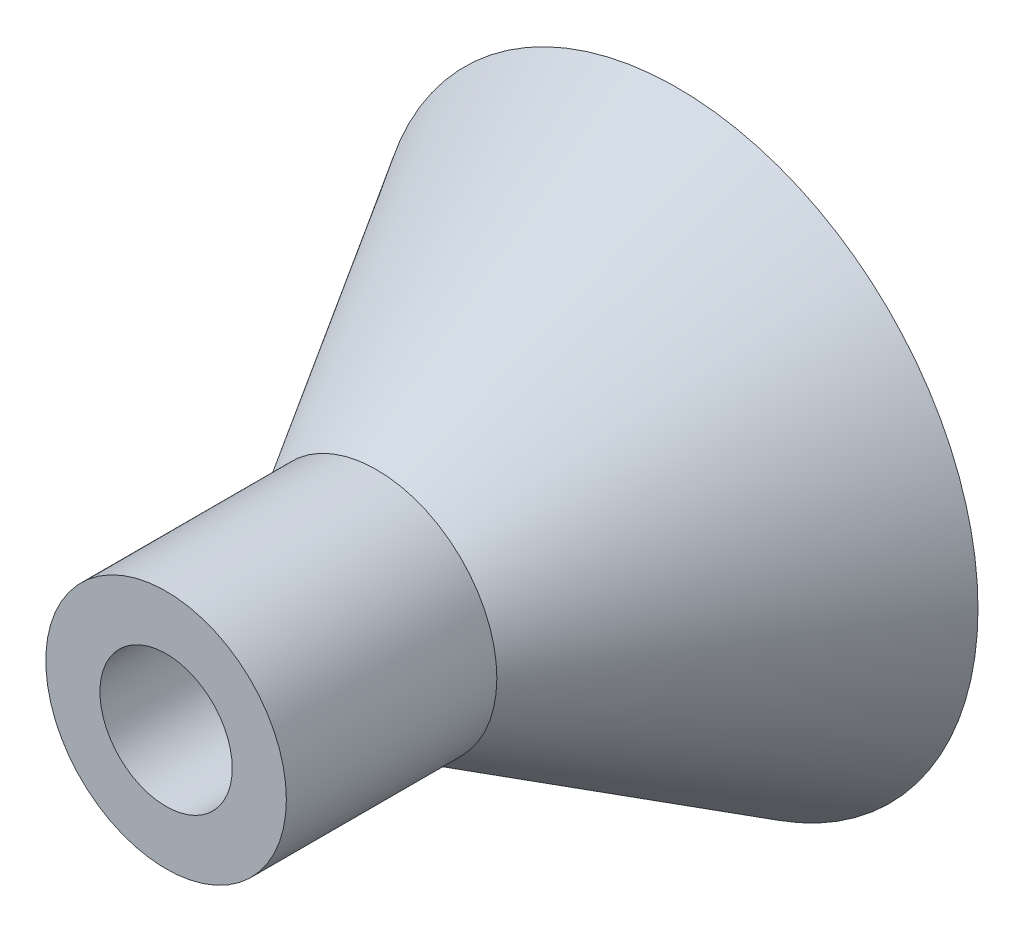
ISO-10303-21;
HEADER;
FILE_DESCRIPTION(('STEP AP214'),'2;1');
FILE_NAME('part.step','',(''),(''),'','','');
FILE_SCHEMA(('AUTOMOTIVE_DESIGN { 1 0 10303 214 1 1 1 1 }'));
ENDSEC;
DATA;
#1=APPLICATION_CONTEXT('core data for automotive mechanical design processes');
#2=APPLICATION_PROTOCOL_DEFINITION('international standard','automotive_design',2000,#1);
#3=PRODUCT_CONTEXT('',#1,'mechanical');
#4=PRODUCT('Part','Part','',(#3));
#5=PRODUCT_RELATED_PRODUCT_CATEGORY('part','',(#4));
#6=PRODUCT_DEFINITION_FORMATION('','',#4);
#7=PRODUCT_DEFINITION_CONTEXT('part definition',#1,'design');
#8=PRODUCT_DEFINITION('design','',#6,#7);
#9=PRODUCT_DEFINITION_SHAPE('','',#8);
#10=(LENGTH_UNIT() NAMED_UNIT(*) SI_UNIT(.MILLI.,.METRE.));
#11=(NAMED_UNIT(*) PLANE_ANGLE_UNIT() SI_UNIT($,.RADIAN.));
#12=(NAMED_UNIT(*) SI_UNIT($,.STERADIAN.) SOLID_ANGLE_UNIT());
#13=UNCERTAINTY_MEASURE_WITH_UNIT(LENGTH_MEASURE(1.E-05),#10,'distance_accuracy_value','');
#14=(GEOMETRIC_REPRESENTATION_CONTEXT(3) GLOBAL_UNCERTAINTY_ASSIGNED_CONTEXT((#13)) GLOBAL_UNIT_ASSIGNED_CONTEXT((#10,
#11,#12)) REPRESENTATION_CONTEXT('',''));
#15=CARTESIAN_POINT('',(0.,0.,0.));
#16=DIRECTION('',(0.,0.,1.));
#17=DIRECTION('',(1.,0.,0.));
#18=AXIS2_PLACEMENT_3D('',#15,#16,#17);
#19=CARTESIAN_POINT('',(0.,0.,0.));
#20=DIRECTION('',(0.,0.,1.));
#21=DIRECTION('',(1.,0.,0.));
#22=AXIS2_PLACEMENT_3D('',#19,#20,#21);
#23=PLANE('',#22);
#24=CARTESIAN_POINT('',(0.,0.,0.));
#25=DIRECTION('',(0.,0.,1.));
#26=DIRECTION('',(1.,0.,0.));
#27=AXIS2_PLACEMENT_3D('',#24,#25,#26);
#28=CIRCLE('',#27,2.2);
#29=CARTESIAN_POINT('',(2.2,0.,0.));
#30=VERTEX_POINT('',#29);
#31=EDGE_CURVE('E56',#30,#30,#28,.T.);
#32=ORIENTED_EDGE('',*,*,#31,.T.);
#33=EDGE_LOOP('',(#32));
#34=FACE_BOUND('',#33,.T.);
#35=CARTESIAN_POINT('',(0.,0.,0.));
#36=DIRECTION('',(0.,0.,1.));
#37=DIRECTION('',(1.,0.,0.));
#38=AXIS2_PLACEMENT_3D('',#35,#36,#37);
#39=CIRCLE('',#38,10.);
#40=CARTESIAN_POINT('',(10.,0.,0.));
#41=VERTEX_POINT('',#40);
#42=EDGE_CURVE('E11',#41,#41,#39,.T.);
#43=ORIENTED_EDGE('',*,*,#42,.F.);
#44=EDGE_LOOP('',(#43));
#45=FACE_BOUND('',#44,.T.);
#46=ADVANCED_FACE('F42',(#34,#45),#23,.F.);
#47=CARTESIAN_POINT('',(0.,0.,10.));
#48=DIRECTION('',(0.,0.,-1.));
#49=DIRECTION('',(-1.,0.,0.));
#50=AXIS2_PLACEMENT_3D('',#47,#48,#49);
#51=CONICAL_SURFACE('',#50,4.,0.540419500270584);
#52=ORIENTED_EDGE('',*,*,#42,.T.);
#53=EDGE_LOOP('',(#52));
#54=FACE_BOUND('',#53,.T.);
#55=CARTESIAN_POINT('',(0.,0.,10.));
#56=DIRECTION('',(0.,0.,1.));
#57=DIRECTION('',(1.,0.,0.));
#58=AXIS2_PLACEMENT_3D('',#55,#56,#57);
#59=CIRCLE('',#58,4.);
#60=CARTESIAN_POINT('',(4.,0.,10.));
#61=VERTEX_POINT('',#60);
#62=EDGE_CURVE('E48',#61,#61,#59,.T.);
#63=ORIENTED_EDGE('',*,*,#62,.F.);
#64=EDGE_LOOP('',(#63));
#65=FACE_BOUND('',#64,.T.);
#66=ADVANCED_FACE('F81',(#54,#65),#51,.T.);
#67=CARTESIAN_POINT('',(0.,0.,17.));
#68=DIRECTION('',(0.,0.,-1.));
#69=DIRECTION('',(-1.,0.,0.));
#70=AXIS2_PLACEMENT_3D('',#67,#68,#69);
#71=CYLINDRICAL_SURFACE('',#70,4.);
#72=CARTESIAN_POINT('',(0.,0.,17.));
#73=DIRECTION('',(0.,0.,1.));
#74=DIRECTION('',(1.,0.,0.));
#75=AXIS2_PLACEMENT_3D('',#72,#73,#74);
#76=CIRCLE('',#75,4.);
#77=CARTESIAN_POINT('',(4.,0.,17.));
#78=VERTEX_POINT('',#77);
#79=EDGE_CURVE('E52',#78,#78,#76,.T.);
#80=ORIENTED_EDGE('',*,*,#79,.F.);
#81=EDGE_LOOP('',(#80));
#82=FACE_BOUND('',#81,.T.);
#83=ORIENTED_EDGE('',*,*,#62,.T.);
#84=EDGE_LOOP('',(#83));
#85=FACE_BOUND('',#84,.T.);
#86=ADVANCED_FACE('F76',(#82,#85),#71,.T.);
#87=CARTESIAN_POINT('',(0.,0.,17.));
#88=DIRECTION('',(0.,0.,1.));
#89=DIRECTION('',(1.,0.,0.));
#90=AXIS2_PLACEMENT_3D('',#87,#88,#89);
#91=PLANE('',#90);
#92=CARTESIAN_POINT('',(0.,0.,17.));
#93=DIRECTION('',(0.,0.,1.));
#94=DIRECTION('',(1.,0.,0.));
#95=AXIS2_PLACEMENT_3D('',#92,#93,#94);
#96=CIRCLE('',#95,2.2);
#97=CARTESIAN_POINT('',(2.2,0.,17.));
#98=VERTEX_POINT('',#97);
#99=EDGE_CURVE('E59',#98,#98,#96,.T.);
#100=ORIENTED_EDGE('',*,*,#99,.F.);
#101=EDGE_LOOP('',(#100));
#102=FACE_BOUND('',#101,.T.);
#103=ORIENTED_EDGE('',*,*,#79,.T.);
#104=EDGE_LOOP('',(#103));
#105=FACE_BOUND('',#104,.T.);
#106=ADVANCED_FACE('F70',(#102,#105),#91,.T.);
#107=CARTESIAN_POINT('',(0.,0.,0.));
#108=DIRECTION('',(0.,0.,1.));
#109=DIRECTION('',(1.,0.,0.));
#110=AXIS2_PLACEMENT_3D('',#107,#108,#109);
#111=CYLINDRICAL_SURFACE('',#110,2.2);
#112=ORIENTED_EDGE('',*,*,#31,.F.);
#113=EDGE_LOOP('',(#112));
#114=FACE_BOUND('',#113,.T.);
#115=ORIENTED_EDGE('',*,*,#99,.T.);
#116=EDGE_LOOP('',(#115));
#117=FACE_BOUND('',#116,.T.);
#118=ADVANCED_FACE('F67',(#114,#117),#111,.F.);
#119=CLOSED_SHELL('',(#46,#66,#86,#106,#118));
#120=MANIFOLD_SOLID_BREP('B2',#119);
#121=ADVANCED_BREP_SHAPE_REPRESENTATION('',(#18,#120),#14);
#122=SHAPE_DEFINITION_REPRESENTATION(#9,#121);
ENDSEC;
END-ISO-10303-21;
